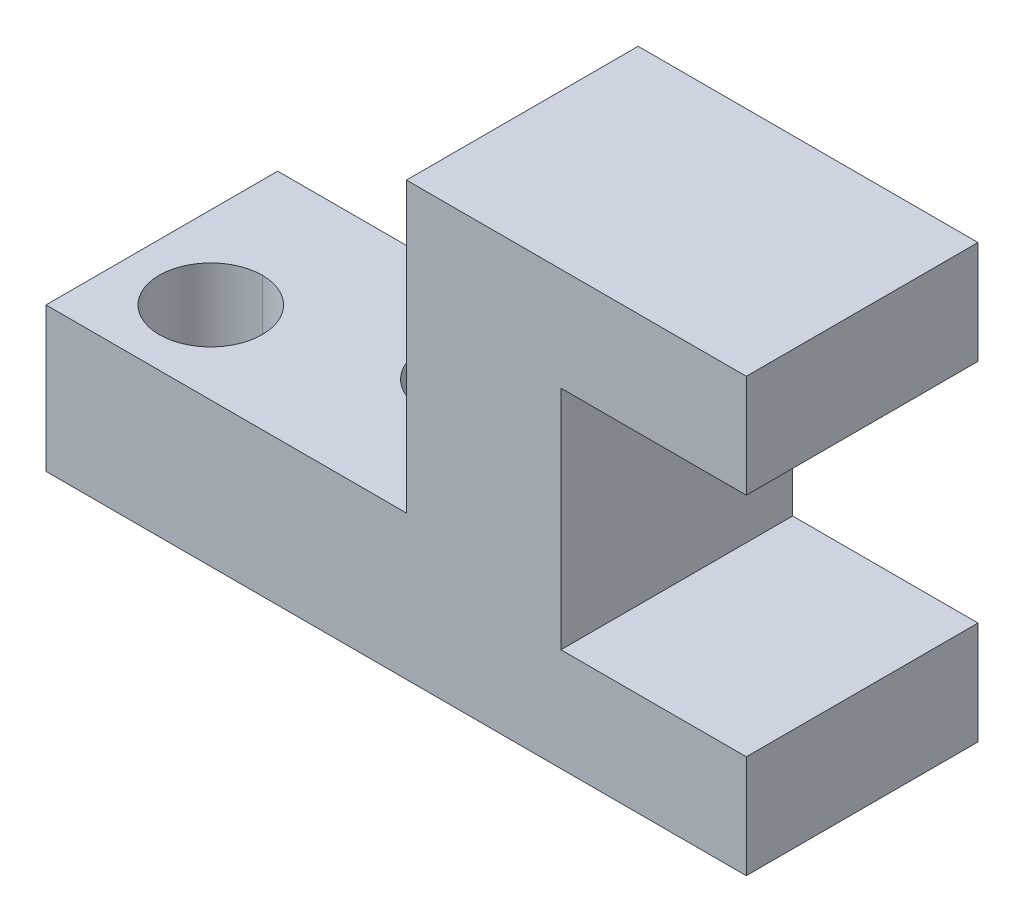
ISO-10303-21;
HEADER;
FILE_DESCRIPTION(('STEP AP214'),'2;1');
FILE_NAME('part.step','',(''),(''),'','','');
FILE_SCHEMA(('AUTOMOTIVE_DESIGN { 1 0 10303 214 1 1 1 1 }'));
ENDSEC;
DATA;
#1=APPLICATION_CONTEXT('core data for automotive mechanical design processes');
#2=APPLICATION_PROTOCOL_DEFINITION('international standard','automotive_design',2000,#1);
#3=PRODUCT_CONTEXT('',#1,'mechanical');
#4=PRODUCT('Part','Part','',(#3));
#5=PRODUCT_RELATED_PRODUCT_CATEGORY('part','',(#4));
#6=PRODUCT_DEFINITION_FORMATION('','',#4);
#7=PRODUCT_DEFINITION_CONTEXT('part definition',#1,'design');
#8=PRODUCT_DEFINITION('design','',#6,#7);
#9=PRODUCT_DEFINITION_SHAPE('','',#8);
#10=(LENGTH_UNIT() NAMED_UNIT(*) SI_UNIT(.MILLI.,.METRE.));
#11=(NAMED_UNIT(*) PLANE_ANGLE_UNIT() SI_UNIT($,.RADIAN.));
#12=(NAMED_UNIT(*) SI_UNIT($,.STERADIAN.) SOLID_ANGLE_UNIT());
#13=UNCERTAINTY_MEASURE_WITH_UNIT(LENGTH_MEASURE(1.E-05),#10,'distance_accuracy_value','');
#14=(GEOMETRIC_REPRESENTATION_CONTEXT(3) GLOBAL_UNCERTAINTY_ASSIGNED_CONTEXT((#13)) GLOBAL_UNIT_ASSIGNED_CONTEXT((#10,
#11,#12)) REPRESENTATION_CONTEXT('',''));
#15=CARTESIAN_POINT('',(0.,0.,0.));
#16=DIRECTION('',(0.,0.,1.));
#17=DIRECTION('',(1.,0.,0.));
#18=AXIS2_PLACEMENT_3D('',#15,#16,#17);
#19=CARTESIAN_POINT('',(-8.2,-7.2,1.6));
#20=DIRECTION('',(0.,1.,0.));
#21=DIRECTION('',(0.,0.,1.));
#22=AXIS2_PLACEMENT_3D('',#19,#20,#21);
#23=CYLINDRICAL_SURFACE('',#22,1.);
#24=DIRECTION('',(0.,1.,0.));
#25=VECTOR('',#24,1.);
#26=CARTESIAN_POINT('',(-8.2,-7.2,0.6));
#27=LINE('',#26,#25);
#28=CARTESIAN_POINT('',(-8.2,0.,0.6));
#29=VERTEX_POINT('',#28);
#30=CARTESIAN_POINT('',(-8.2,2.8,0.6));
#31=VERTEX_POINT('',#30);
#32=EDGE_CURVE('E195',#29,#31,#27,.T.);
#33=ORIENTED_EDGE('',*,*,#32,.F.);
#34=CARTESIAN_POINT('',(-8.2,0.,1.6));
#35=DIRECTION('',(0.,1.,0.));
#36=DIRECTION('',(-1.,0.,0.));
#37=AXIS2_PLACEMENT_3D('',#34,#35,#36);
#38=CIRCLE('',#37,1.);
#39=CARTESIAN_POINT('',(-8.2,0.,2.6));
#40=VERTEX_POINT('',#39);
#41=EDGE_CURVE('E27',#40,#29,#38,.T.);
#42=ORIENTED_EDGE('',*,*,#41,.F.);
#43=DIRECTION('',(0.,1.,0.));
#44=VECTOR('',#43,1.);
#45=CARTESIAN_POINT('',(-8.2,-7.2,2.6));
#46=LINE('',#45,#44);
#47=CARTESIAN_POINT('',(-8.2,2.8,2.6));
#48=VERTEX_POINT('',#47);
#49=EDGE_CURVE('E174',#40,#48,#46,.T.);
#50=ORIENTED_EDGE('',*,*,#49,.T.);
#51=CARTESIAN_POINT('',(-8.2,2.8,1.6));
#52=DIRECTION('',(0.,1.,0.));
#53=DIRECTION('',(0.,0.,1.));
#54=AXIS2_PLACEMENT_3D('',#51,#52,#53);
#55=CIRCLE('',#54,1.);
#56=EDGE_CURVE('E156',#48,#31,#55,.T.);
#57=ORIENTED_EDGE('',*,*,#56,.T.);
#58=EDGE_LOOP('',(#33,#42,#50,#57));
#59=FACE_BOUND('',#58,.T.);
#60=ADVANCED_FACE('F16',(#59),#23,.F.);
#61=CARTESIAN_POINT('',(-12.,-7.2,2.9));
#62=DIRECTION('',(0.,1.,0.));
#63=DIRECTION('',(0.,0.,1.));
#64=AXIS2_PLACEMENT_3D('',#61,#62,#63);
#65=CYLINDRICAL_SURFACE('',#64,1.);
#66=DIRECTION('',(0.,1.,0.));
#67=VECTOR('',#66,1.);
#68=CARTESIAN_POINT('',(-12.,-7.2,1.9));
#69=LINE('',#68,#67);
#70=CARTESIAN_POINT('',(-12.,0.,1.9));
#71=VERTEX_POINT('',#70);
#72=CARTESIAN_POINT('',(-12.,2.8,1.9));
#73=VERTEX_POINT('',#72);
#74=EDGE_CURVE('E148',#71,#73,#69,.T.);
#75=ORIENTED_EDGE('',*,*,#74,.F.);
#76=CARTESIAN_POINT('',(-12.,0.,2.9));
#77=DIRECTION('',(0.,1.,0.));
#78=DIRECTION('',(-1.,0.,0.));
#79=AXIS2_PLACEMENT_3D('',#76,#77,#78);
#80=CIRCLE('',#79,1.);
#81=CARTESIAN_POINT('',(-12.,0.,3.9));
#82=VERTEX_POINT('',#81);
#83=EDGE_CURVE('E10',#82,#71,#80,.T.);
#84=ORIENTED_EDGE('',*,*,#83,.F.);
#85=DIRECTION('',(0.,1.,0.));
#86=VECTOR('',#85,1.);
#87=CARTESIAN_POINT('',(-12.,-7.2,3.9));
#88=LINE('',#87,#86);
#89=CARTESIAN_POINT('',(-12.,2.8,3.9));
#90=VERTEX_POINT('',#89);
#91=EDGE_CURVE('E151',#82,#90,#88,.T.);
#92=ORIENTED_EDGE('',*,*,#91,.T.);
#93=CARTESIAN_POINT('',(-12.,2.8,2.9));
#94=DIRECTION('',(0.,1.,0.));
#95=DIRECTION('',(0.,0.,1.));
#96=AXIS2_PLACEMENT_3D('',#93,#94,#95);
#97=CIRCLE('',#96,1.);
#98=EDGE_CURVE('E145',#90,#73,#97,.T.);
#99=ORIENTED_EDGE('',*,*,#98,.T.);
#100=EDGE_LOOP('',(#75,#84,#92,#99));
#101=FACE_BOUND('',#100,.T.);
#102=ADVANCED_FACE('F18',(#101),#65,.F.);
#103=CARTESIAN_POINT('',(0.,0.,0.));
#104=DIRECTION('',(0.,0.,-1.));
#105=DIRECTION('',(0.,-1.,0.));
#106=AXIS2_PLACEMENT_3D('',#103,#104,#105);
#107=PLANE('',#106);
#108=DIRECTION('',(0.,1.,0.));
#109=VECTOR('',#108,1.);
#110=CARTESIAN_POINT('',(0.,2.,0.));
#111=LINE('',#110,#109);
#112=CARTESIAN_POINT('',(0.,0.,0.));
#113=VERTEX_POINT('',#112);
#114=CARTESIAN_POINT('',(0.,2.,0.));
#115=VERTEX_POINT('',#114);
#116=EDGE_CURVE('E256',#113,#115,#111,.T.);
#117=ORIENTED_EDGE('',*,*,#116,.F.);
#118=DIRECTION('',(1.,0.,0.));
#119=VECTOR('',#118,1.);
#120=CARTESIAN_POINT('',(0.,0.,0.));
#121=LINE('',#120,#119);
#122=CARTESIAN_POINT('',(-13.6,0.,0.));
#123=VERTEX_POINT('',#122);
#124=EDGE_CURVE('E233',#123,#113,#121,.T.);
#125=ORIENTED_EDGE('',*,*,#124,.F.);
#126=DIRECTION('',(0.,-1.,0.));
#127=VECTOR('',#126,1.);
#128=CARTESIAN_POINT('',(-13.6,0.,0.));
#129=LINE('',#128,#127);
#130=CARTESIAN_POINT('',(-13.6,2.8,0.));
#131=VERTEX_POINT('',#130);
#132=EDGE_CURVE('E155',#131,#123,#129,.T.);
#133=ORIENTED_EDGE('',*,*,#132,.F.);
#134=DIRECTION('',(-1.,0.,0.));
#135=VECTOR('',#134,1.);
#136=CARTESIAN_POINT('',(-13.6,2.8,0.));
#137=LINE('',#136,#135);
#138=CARTESIAN_POINT('',(-6.6,2.8,0.));
#139=VERTEX_POINT('',#138);
#140=EDGE_CURVE('E219',#139,#131,#137,.T.);
#141=ORIENTED_EDGE('',*,*,#140,.F.);
#142=DIRECTION('',(0.,-1.,0.));
#143=VECTOR('',#142,1.);
#144=CARTESIAN_POINT('',(-6.6,2.8,0.));
#145=LINE('',#144,#143);
#146=CARTESIAN_POINT('',(-6.6,8.4,0.));
#147=VERTEX_POINT('',#146);
#148=EDGE_CURVE('E213',#147,#139,#145,.T.);
#149=ORIENTED_EDGE('',*,*,#148,.F.);
#150=DIRECTION('',(-1.,0.,0.));
#151=VECTOR('',#150,1.);
#152=CARTESIAN_POINT('',(-6.6,8.4,0.));
#153=LINE('',#152,#151);
#154=CARTESIAN_POINT('',(0.,8.4,0.));
#155=VERTEX_POINT('',#154);
#156=EDGE_CURVE('E224',#155,#147,#153,.T.);
#157=ORIENTED_EDGE('',*,*,#156,.F.);
#158=DIRECTION('',(0.,1.,0.));
#159=VECTOR('',#158,1.);
#160=CARTESIAN_POINT('',(0.,8.4,0.));
#161=LINE('',#160,#159);
#162=CARTESIAN_POINT('',(0.,6.4,0.));
#163=VERTEX_POINT('',#162);
#164=EDGE_CURVE('E237',#163,#155,#161,.T.);
#165=ORIENTED_EDGE('',*,*,#164,.F.);
#166=DIRECTION('',(1.,0.,0.));
#167=VECTOR('',#166,1.);
#168=CARTESIAN_POINT('',(0.,6.4,0.));
#169=LINE('',#168,#167);
#170=CARTESIAN_POINT('',(-3.6,6.4,0.));
#171=VERTEX_POINT('',#170);
#172=EDGE_CURVE('E190',#171,#163,#169,.T.);
#173=ORIENTED_EDGE('',*,*,#172,.F.);
#174=DIRECTION('',(0.,1.,0.));
#175=VECTOR('',#174,1.);
#176=CARTESIAN_POINT('',(-3.6,6.4,0.));
#177=LINE('',#176,#175);
#178=CARTESIAN_POINT('',(-3.6,2.,0.));
#179=VERTEX_POINT('',#178);
#180=EDGE_CURVE('E183',#179,#171,#177,.T.);
#181=ORIENTED_EDGE('',*,*,#180,.F.);
#182=DIRECTION('',(-1.,0.,0.));
#183=VECTOR('',#182,1.);
#184=CARTESIAN_POINT('',(-3.6,2.,0.));
#185=LINE('',#184,#183);
#186=EDGE_CURVE('E196',#115,#179,#185,.T.);
#187=ORIENTED_EDGE('',*,*,#186,.F.);
#188=EDGE_LOOP('',(#117,#125,#133,#141,#149,#157,#165,#173,#181,#187));
#189=FACE_BOUND('',#188,.T.);
#190=ADVANCED_FACE('F495',(#189),#107,.T.);
#191=CARTESIAN_POINT('',(0.,0.,4.5));
#192=DIRECTION('',(0.,0.,-1.));
#193=DIRECTION('',(0.,-1.,0.));
#194=AXIS2_PLACEMENT_3D('',#191,#192,#193);
#195=PLANE('',#194);
#196=DIRECTION('',(0.,1.,0.));
#197=VECTOR('',#196,1.);
#198=CARTESIAN_POINT('',(0.,2.,4.5));
#199=LINE('',#198,#197);
#200=CARTESIAN_POINT('',(0.,0.,4.5));
#201=VERTEX_POINT('',#200);
#202=CARTESIAN_POINT('',(0.,2.,4.5));
#203=VERTEX_POINT('',#202);
#204=EDGE_CURVE('E255',#201,#203,#199,.T.);
#205=ORIENTED_EDGE('',*,*,#204,.T.);
#206=DIRECTION('',(-1.,0.,0.));
#207=VECTOR('',#206,1.);
#208=CARTESIAN_POINT('',(-3.6,2.,4.5));
#209=LINE('',#208,#207);
#210=CARTESIAN_POINT('',(-3.6,2.,4.5));
#211=VERTEX_POINT('',#210);
#212=EDGE_CURVE('E179',#203,#211,#209,.T.);
#213=ORIENTED_EDGE('',*,*,#212,.T.);
#214=DIRECTION('',(0.,1.,0.));
#215=VECTOR('',#214,1.);
#216=CARTESIAN_POINT('',(-3.6,6.4,4.5));
#217=LINE('',#216,#215);
#218=CARTESIAN_POINT('',(-3.6,6.4,4.5));
#219=VERTEX_POINT('',#218);
#220=EDGE_CURVE('E212',#211,#219,#217,.T.);
#221=ORIENTED_EDGE('',*,*,#220,.T.);
#222=DIRECTION('',(1.,0.,0.));
#223=VECTOR('',#222,1.);
#224=CARTESIAN_POINT('',(0.,6.4,4.5));
#225=LINE('',#224,#223);
#226=CARTESIAN_POINT('',(0.,6.4,4.5));
#227=VERTEX_POINT('',#226);
#228=EDGE_CURVE('E189',#219,#227,#225,.T.);
#229=ORIENTED_EDGE('',*,*,#228,.T.);
#230=DIRECTION('',(0.,1.,0.));
#231=VECTOR('',#230,1.);
#232=CARTESIAN_POINT('',(0.,8.4,4.5));
#233=LINE('',#232,#231);
#234=CARTESIAN_POINT('',(0.,8.4,4.5));
#235=VERTEX_POINT('',#234);
#236=EDGE_CURVE('E229',#227,#235,#233,.T.);
#237=ORIENTED_EDGE('',*,*,#236,.T.);
#238=DIRECTION('',(-1.,0.,0.));
#239=VECTOR('',#238,1.);
#240=CARTESIAN_POINT('',(-6.6,8.4,4.5));
#241=LINE('',#240,#239);
#242=CARTESIAN_POINT('',(-6.6,8.4,4.5));
#243=VERTEX_POINT('',#242);
#244=EDGE_CURVE('E218',#235,#243,#241,.T.);
#245=ORIENTED_EDGE('',*,*,#244,.T.);
#246=DIRECTION('',(0.,-1.,0.));
#247=VECTOR('',#246,1.);
#248=CARTESIAN_POINT('',(-6.6,2.8,4.5));
#249=LINE('',#248,#247);
#250=CARTESIAN_POINT('',(-6.6,2.8,4.5));
#251=VERTEX_POINT('',#250);
#252=EDGE_CURVE('E222',#243,#251,#249,.T.);
#253=ORIENTED_EDGE('',*,*,#252,.T.);
#254=DIRECTION('',(-1.,0.,0.));
#255=VECTOR('',#254,1.);
#256=CARTESIAN_POINT('',(-13.6,2.8,4.5));
#257=LINE('',#256,#255);
#258=CARTESIAN_POINT('',(-13.6,2.8,4.5));
#259=VERTEX_POINT('',#258);
#260=EDGE_CURVE('E273',#251,#259,#257,.T.);
#261=ORIENTED_EDGE('',*,*,#260,.T.);
#262=DIRECTION('',(0.,-1.,0.));
#263=VECTOR('',#262,1.);
#264=CARTESIAN_POINT('',(-13.6,0.,4.5));
#265=LINE('',#264,#263);
#266=CARTESIAN_POINT('',(-13.6,0.,4.5));
#267=VERTEX_POINT('',#266);
#268=EDGE_CURVE('E230',#259,#267,#265,.T.);
#269=ORIENTED_EDGE('',*,*,#268,.T.);
#270=DIRECTION('',(1.,0.,0.));
#271=VECTOR('',#270,1.);
#272=CARTESIAN_POINT('',(0.,0.,4.5));
#273=LINE('',#272,#271);
#274=EDGE_CURVE('E42',#267,#201,#273,.T.);
#275=ORIENTED_EDGE('',*,*,#274,.T.);
#276=EDGE_LOOP('',(#205,#213,#221,#229,#237,#245,#253,#261,#269,#275));
#277=FACE_BOUND('',#276,.T.);
#278=ADVANCED_FACE('F300',(#277),#195,.F.);
#279=CARTESIAN_POINT('',(0.,0.,4.5));
#280=DIRECTION('',(0.,1.,0.));
#281=DIRECTION('',(1.,0.,0.));
#282=AXIS2_PLACEMENT_3D('',#279,#280,#281);
#283=PLANE('',#282);
#284=ORIENTED_EDGE('',*,*,#83,.T.);
#285=CARTESIAN_POINT('',(-12.,0.,2.9));
#286=DIRECTION('',(0.,1.,0.));
#287=DIRECTION('',(-1.,0.,0.));
#288=AXIS2_PLACEMENT_3D('',#285,#286,#287);
#289=CIRCLE('',#288,1.);
#290=EDGE_CURVE('E166',#71,#82,#289,.T.);
#291=ORIENTED_EDGE('',*,*,#290,.T.);
#292=EDGE_LOOP('',(#284,#291));
#293=FACE_BOUND('',#292,.T.);
#294=ORIENTED_EDGE('',*,*,#41,.T.);
#295=CARTESIAN_POINT('',(-8.2,0.,1.6));
#296=DIRECTION('',(0.,1.,0.));
#297=DIRECTION('',(-1.,0.,0.));
#298=AXIS2_PLACEMENT_3D('',#295,#296,#297);
#299=CIRCLE('',#298,1.);
#300=EDGE_CURVE('E204',#29,#40,#299,.T.);
#301=ORIENTED_EDGE('',*,*,#300,.T.);
#302=EDGE_LOOP('',(#294,#301));
#303=FACE_BOUND('',#302,.T.);
#304=ORIENTED_EDGE('',*,*,#124,.T.);
#305=DIRECTION('',(0.,0.,-1.));
#306=VECTOR('',#305,1.);
#307=CARTESIAN_POINT('',(0.,0.,4.5));
#308=LINE('',#307,#306);
#309=EDGE_CURVE('E200',#201,#113,#308,.T.);
#310=ORIENTED_EDGE('',*,*,#309,.F.);
#311=ORIENTED_EDGE('',*,*,#274,.F.);
#312=DIRECTION('',(0.,0.,-1.));
#313=VECTOR('',#312,1.);
#314=CARTESIAN_POINT('',(-13.6,0.,4.5));
#315=LINE('',#314,#313);
#316=EDGE_CURVE('E234',#267,#123,#315,.T.);
#317=ORIENTED_EDGE('',*,*,#316,.T.);
#318=EDGE_LOOP('',(#304,#310,#311,#317));
#319=FACE_BOUND('',#318,.T.);
#320=ADVANCED_FACE('F468',(#293,#303,#319),#283,.F.);
#321=CARTESIAN_POINT('',(-13.6,0.,4.5));
#322=DIRECTION('',(1.,0.,0.));
#323=DIRECTION('',(0.,1.,0.));
#324=AXIS2_PLACEMENT_3D('',#321,#322,#323);
#325=PLANE('',#324);
#326=ORIENTED_EDGE('',*,*,#132,.T.);
#327=ORIENTED_EDGE('',*,*,#316,.F.);
#328=ORIENTED_EDGE('',*,*,#268,.F.);
#329=DIRECTION('',(0.,0.,-1.));
#330=VECTOR('',#329,1.);
#331=CARTESIAN_POINT('',(-13.6,2.8,4.5));
#332=LINE('',#331,#330);
#333=EDGE_CURVE('E20',#259,#131,#332,.T.);
#334=ORIENTED_EDGE('',*,*,#333,.T.);
#335=EDGE_LOOP('',(#326,#327,#328,#334));
#336=FACE_BOUND('',#335,.T.);
#337=ADVANCED_FACE('F472',(#336),#325,.F.);
#338=CARTESIAN_POINT('',(-13.6,2.8,4.5));
#339=DIRECTION('',(0.,-1.,0.));
#340=DIRECTION('',(0.,0.,-1.));
#341=AXIS2_PLACEMENT_3D('',#338,#339,#340);
#342=PLANE('',#341);
#343=ORIENTED_EDGE('',*,*,#98,.F.);
#344=CARTESIAN_POINT('',(-12.,2.8,2.9));
#345=DIRECTION('',(0.,1.,0.));
#346=DIRECTION('',(0.,0.,1.));
#347=AXIS2_PLACEMENT_3D('',#344,#345,#346);
#348=CIRCLE('',#347,1.);
#349=EDGE_CURVE('E158',#73,#90,#348,.T.);
#350=ORIENTED_EDGE('',*,*,#349,.F.);
#351=EDGE_LOOP('',(#343,#350));
#352=FACE_BOUND('',#351,.T.);
#353=ORIENTED_EDGE('',*,*,#56,.F.);
#354=CARTESIAN_POINT('',(-8.2,2.8,1.6));
#355=DIRECTION('',(0.,1.,0.));
#356=DIRECTION('',(0.,0.,1.));
#357=AXIS2_PLACEMENT_3D('',#354,#355,#356);
#358=CIRCLE('',#357,1.);
#359=EDGE_CURVE('E191',#31,#48,#358,.T.);
#360=ORIENTED_EDGE('',*,*,#359,.F.);
#361=EDGE_LOOP('',(#353,#360));
#362=FACE_BOUND('',#361,.T.);
#363=ORIENTED_EDGE('',*,*,#140,.T.);
#364=ORIENTED_EDGE('',*,*,#333,.F.);
#365=ORIENTED_EDGE('',*,*,#260,.F.);
#366=DIRECTION('',(0.,0.,-1.));
#367=VECTOR('',#366,1.);
#368=CARTESIAN_POINT('',(-6.6,2.8,4.5));
#369=LINE('',#368,#367);
#370=EDGE_CURVE('E217',#251,#139,#369,.T.);
#371=ORIENTED_EDGE('',*,*,#370,.T.);
#372=EDGE_LOOP('',(#363,#364,#365,#371));
#373=FACE_BOUND('',#372,.T.);
#374=ADVANCED_FACE('F159',(#352,#362,#373),#342,.F.);
#375=CARTESIAN_POINT('',(-6.6,2.8,4.5));
#376=DIRECTION('',(1.,0.,0.));
#377=DIRECTION('',(0.,1.,0.));
#378=AXIS2_PLACEMENT_3D('',#375,#376,#377);
#379=PLANE('',#378);
#380=ORIENTED_EDGE('',*,*,#148,.T.);
#381=ORIENTED_EDGE('',*,*,#370,.F.);
#382=ORIENTED_EDGE('',*,*,#252,.F.);
#383=DIRECTION('',(0.,0.,-1.));
#384=VECTOR('',#383,1.);
#385=CARTESIAN_POINT('',(-6.6,8.4,4.5));
#386=LINE('',#385,#384);
#387=EDGE_CURVE('E228',#243,#147,#386,.T.);
#388=ORIENTED_EDGE('',*,*,#387,.T.);
#389=EDGE_LOOP('',(#380,#381,#382,#388));
#390=FACE_BOUND('',#389,.T.);
#391=ADVANCED_FACE('F305',(#390),#379,.F.);
#392=CARTESIAN_POINT('',(-6.6,8.4,4.5));
#393=DIRECTION('',(0.,-1.,0.));
#394=DIRECTION('',(-1.,0.,0.));
#395=AXIS2_PLACEMENT_3D('',#392,#393,#394);
#396=PLANE('',#395);
#397=ORIENTED_EDGE('',*,*,#156,.T.);
#398=ORIENTED_EDGE('',*,*,#387,.F.);
#399=ORIENTED_EDGE('',*,*,#244,.F.);
#400=DIRECTION('',(0.,0.,-1.));
#401=VECTOR('',#400,1.);
#402=CARTESIAN_POINT('',(0.,8.4,4.5));
#403=LINE('',#402,#401);
#404=EDGE_CURVE('E269',#235,#155,#403,.T.);
#405=ORIENTED_EDGE('',*,*,#404,.T.);
#406=EDGE_LOOP('',(#397,#398,#399,#405));
#407=FACE_BOUND('',#406,.T.);
#408=ADVANCED_FACE('F481',(#407),#396,.F.);
#409=CARTESIAN_POINT('',(0.,8.4,4.5));
#410=DIRECTION('',(-1.,0.,0.));
#411=DIRECTION('',(0.,1.,0.));
#412=AXIS2_PLACEMENT_3D('',#409,#410,#411);
#413=PLANE('',#412);
#414=ORIENTED_EDGE('',*,*,#164,.T.);
#415=ORIENTED_EDGE('',*,*,#404,.F.);
#416=ORIENTED_EDGE('',*,*,#236,.F.);
#417=DIRECTION('',(0.,0.,-1.));
#418=VECTOR('',#417,1.);
#419=CARTESIAN_POINT('',(0.,6.4,4.5));
#420=LINE('',#419,#418);
#421=EDGE_CURVE('E185',#227,#163,#420,.T.);
#422=ORIENTED_EDGE('',*,*,#421,.T.);
#423=EDGE_LOOP('',(#414,#415,#416,#422));
#424=FACE_BOUND('',#423,.T.);
#425=ADVANCED_FACE('F509',(#424),#413,.F.);
#426=CARTESIAN_POINT('',(0.,6.4,4.5));
#427=DIRECTION('',(0.,1.,0.));
#428=DIRECTION('',(1.,0.,0.));
#429=AXIS2_PLACEMENT_3D('',#426,#427,#428);
#430=PLANE('',#429);
#431=ORIENTED_EDGE('',*,*,#172,.T.);
#432=ORIENTED_EDGE('',*,*,#421,.F.);
#433=ORIENTED_EDGE('',*,*,#228,.F.);
#434=DIRECTION('',(0.,0.,-1.));
#435=VECTOR('',#434,1.);
#436=CARTESIAN_POINT('',(-3.6,6.4,4.5));
#437=LINE('',#436,#435);
#438=EDGE_CURVE('E208',#219,#171,#437,.T.);
#439=ORIENTED_EDGE('',*,*,#438,.T.);
#440=EDGE_LOOP('',(#431,#432,#433,#439));
#441=FACE_BOUND('',#440,.T.);
#442=ADVANCED_FACE('F504',(#441),#430,.F.);
#443=CARTESIAN_POINT('',(-3.6,6.4,4.5));
#444=DIRECTION('',(-1.,0.,0.));
#445=DIRECTION('',(0.,1.,0.));
#446=AXIS2_PLACEMENT_3D('',#443,#444,#445);
#447=PLANE('',#446);
#448=ORIENTED_EDGE('',*,*,#180,.T.);
#449=ORIENTED_EDGE('',*,*,#438,.F.);
#450=ORIENTED_EDGE('',*,*,#220,.F.);
#451=DIRECTION('',(0.,0.,-1.));
#452=VECTOR('',#451,1.);
#453=CARTESIAN_POINT('',(-3.6,2.,4.5));
#454=LINE('',#453,#452);
#455=EDGE_CURVE('E184',#211,#179,#454,.T.);
#456=ORIENTED_EDGE('',*,*,#455,.T.);
#457=EDGE_LOOP('',(#448,#449,#450,#456));
#458=FACE_BOUND('',#457,.T.);
#459=ADVANCED_FACE('F508',(#458),#447,.F.);
#460=CARTESIAN_POINT('',(-3.6,2.,4.5));
#461=DIRECTION('',(0.,-1.,0.));
#462=DIRECTION('',(0.,0.,-1.));
#463=AXIS2_PLACEMENT_3D('',#460,#461,#462);
#464=PLANE('',#463);
#465=ORIENTED_EDGE('',*,*,#186,.T.);
#466=ORIENTED_EDGE('',*,*,#455,.F.);
#467=ORIENTED_EDGE('',*,*,#212,.F.);
#468=DIRECTION('',(0.,0.,-1.));
#469=VECTOR('',#468,1.);
#470=CARTESIAN_POINT('',(0.,2.,4.5));
#471=LINE('',#470,#469);
#472=EDGE_CURVE('E252',#203,#115,#471,.T.);
#473=ORIENTED_EDGE('',*,*,#472,.T.);
#474=EDGE_LOOP('',(#465,#466,#467,#473));
#475=FACE_BOUND('',#474,.T.);
#476=ADVANCED_FACE('F548',(#475),#464,.F.);
#477=CARTESIAN_POINT('',(0.,2.,4.5));
#478=DIRECTION('',(-1.,0.,0.));
#479=DIRECTION('',(0.,1.,0.));
#480=AXIS2_PLACEMENT_3D('',#477,#478,#479);
#481=PLANE('',#480);
#482=ORIENTED_EDGE('',*,*,#116,.T.);
#483=ORIENTED_EDGE('',*,*,#472,.F.);
#484=ORIENTED_EDGE('',*,*,#204,.F.);
#485=ORIENTED_EDGE('',*,*,#309,.T.);
#486=EDGE_LOOP('',(#482,#483,#484,#485));
#487=FACE_BOUND('',#486,.T.);
#488=ADVANCED_FACE('F490',(#487),#481,.F.);
#489=CARTESIAN_POINT('',(-12.,-7.2,2.9));
#490=DIRECTION('',(0.,1.,0.));
#491=DIRECTION('',(0.,0.,1.));
#492=AXIS2_PLACEMENT_3D('',#489,#490,#491);
#493=CYLINDRICAL_SURFACE('',#492,1.);
#494=ORIENTED_EDGE('',*,*,#290,.F.);
#495=ORIENTED_EDGE('',*,*,#74,.T.);
#496=ORIENTED_EDGE('',*,*,#349,.T.);
#497=ORIENTED_EDGE('',*,*,#91,.F.);
#498=EDGE_LOOP('',(#494,#495,#496,#497));
#499=FACE_BOUND('',#498,.T.);
#500=ADVANCED_FACE('F164',(#499),#493,.F.);
#501=CARTESIAN_POINT('',(-8.2,-7.2,1.6));
#502=DIRECTION('',(0.,1.,0.));
#503=DIRECTION('',(0.,0.,1.));
#504=AXIS2_PLACEMENT_3D('',#501,#502,#503);
#505=CYLINDRICAL_SURFACE('',#504,1.);
#506=ORIENTED_EDGE('',*,*,#300,.F.);
#507=ORIENTED_EDGE('',*,*,#32,.T.);
#508=ORIENTED_EDGE('',*,*,#359,.T.);
#509=ORIENTED_EDGE('',*,*,#49,.F.);
#510=EDGE_LOOP('',(#506,#507,#508,#509));
#511=FACE_BOUND('',#510,.T.);
#512=ADVANCED_FACE('F489',(#511),#505,.F.);
#513=CLOSED_SHELL('',(#60,#102,#190,#278,#320,#337,#374,#391,#408,#425,#442,#459,#476,#488,#500,#512));
#514=MANIFOLD_SOLID_BREP('B1',#513);
#515=ADVANCED_BREP_SHAPE_REPRESENTATION('',(#18,#514),#14);
#516=SHAPE_DEFINITION_REPRESENTATION(#9,#515);
ENDSEC;
END-ISO-10303-21;
